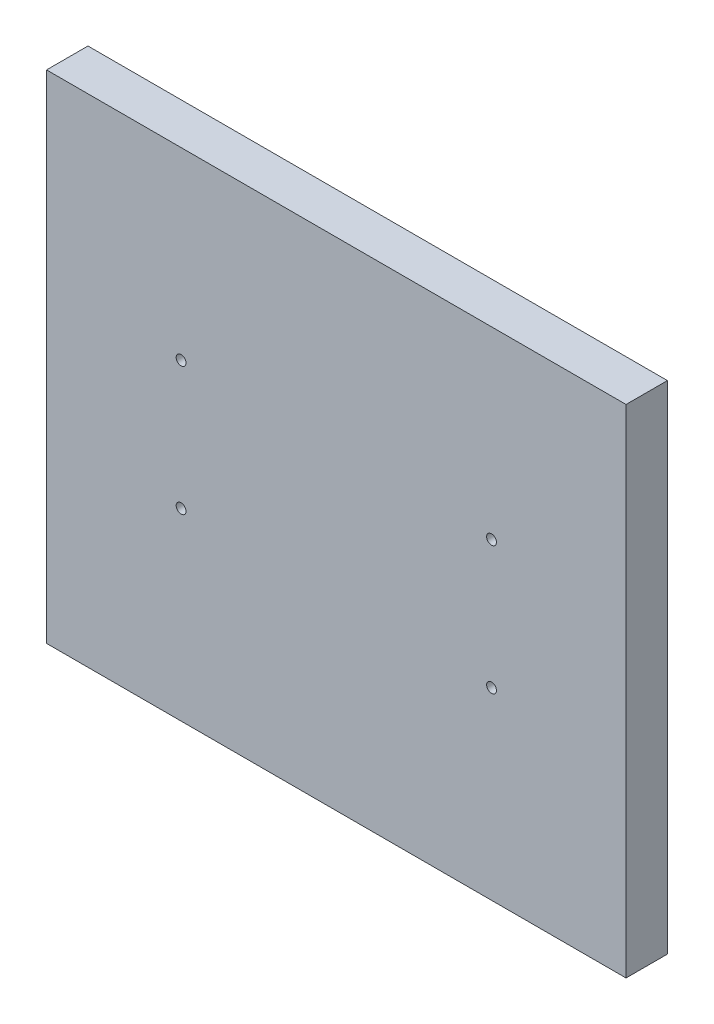
ISO-10303-21;
HEADER;
FILE_DESCRIPTION(('STEP AP214'),'2;1');
FILE_NAME('part.step','',(''),(''),'','','');
FILE_SCHEMA(('AUTOMOTIVE_DESIGN { 1 0 10303 214 1 1 1 1 }'));
ENDSEC;
DATA;
#1=APPLICATION_CONTEXT('core data for automotive mechanical design processes');
#2=APPLICATION_PROTOCOL_DEFINITION('international standard','automotive_design',2000,#1);
#3=PRODUCT_CONTEXT('',#1,'mechanical');
#4=PRODUCT('Part','Part','',(#3));
#5=PRODUCT_RELATED_PRODUCT_CATEGORY('part','',(#4));
#6=PRODUCT_DEFINITION_FORMATION('','',#4);
#7=PRODUCT_DEFINITION_CONTEXT('part definition',#1,'design');
#8=PRODUCT_DEFINITION('design','',#6,#7);
#9=PRODUCT_DEFINITION_SHAPE('','',#8);
#10=(LENGTH_UNIT() NAMED_UNIT(*) SI_UNIT(.MILLI.,.METRE.));
#11=(NAMED_UNIT(*) PLANE_ANGLE_UNIT() SI_UNIT($,.RADIAN.));
#12=(NAMED_UNIT(*) SI_UNIT($,.STERADIAN.) SOLID_ANGLE_UNIT());
#13=UNCERTAINTY_MEASURE_WITH_UNIT(LENGTH_MEASURE(1.E-05),#10,'distance_accuracy_value','');
#14=(GEOMETRIC_REPRESENTATION_CONTEXT(3) GLOBAL_UNCERTAINTY_ASSIGNED_CONTEXT((#13)) GLOBAL_UNIT_ASSIGNED_CONTEXT((#10,
#11,#12)) REPRESENTATION_CONTEXT('',''));
#15=CARTESIAN_POINT('',(0.,0.,0.));
#16=DIRECTION('',(0.,0.,1.));
#17=DIRECTION('',(1.,0.,0.));
#18=AXIS2_PLACEMENT_3D('',#15,#16,#17);
#19=CARTESIAN_POINT('',(70.,60.,10.));
#20=DIRECTION('',(-1.,0.,0.));
#21=DIRECTION('',(0.,-1.,0.));
#22=AXIS2_PLACEMENT_3D('',#19,#20,#21);
#23=PLANE('',#22);
#24=DIRECTION('',(0.,1.,0.));
#25=VECTOR('',#24,1.);
#26=CARTESIAN_POINT('',(70.,60.,0.));
#27=LINE('',#26,#25);
#28=CARTESIAN_POINT('',(70.0000000000001,-60.,0.));
#29=VERTEX_POINT('',#28);
#30=CARTESIAN_POINT('',(70.,60.,0.));
#31=VERTEX_POINT('',#30);
#32=EDGE_CURVE('E126',#29,#31,#27,.T.);
#33=ORIENTED_EDGE('',*,*,#32,.T.);
#34=DIRECTION('',(0.,0.,-1.));
#35=VECTOR('',#34,1.);
#36=CARTESIAN_POINT('',(70.,60.,10.));
#37=LINE('',#36,#35);
#38=CARTESIAN_POINT('',(70.,60.,10.));
#39=VERTEX_POINT('',#38);
#40=EDGE_CURVE('E11',#39,#31,#37,.T.);
#41=ORIENTED_EDGE('',*,*,#40,.F.);
#42=DIRECTION('',(0.,1.,0.));
#43=VECTOR('',#42,1.);
#44=CARTESIAN_POINT('',(70.,60.,10.));
#45=LINE('',#44,#43);
#46=CARTESIAN_POINT('',(70.0000000000001,-60.,10.));
#47=VERTEX_POINT('',#46);
#48=EDGE_CURVE('E127',#47,#39,#45,.T.);
#49=ORIENTED_EDGE('',*,*,#48,.F.);
#50=DIRECTION('',(0.,0.,-1.));
#51=VECTOR('',#50,1.);
#52=CARTESIAN_POINT('',(70.0000000000001,-60.,10.));
#53=LINE('',#52,#51);
#54=EDGE_CURVE('E133',#47,#29,#53,.T.);
#55=ORIENTED_EDGE('',*,*,#54,.T.);
#56=EDGE_LOOP('',(#33,#41,#49,#55));
#57=FACE_BOUND('',#56,.T.);
#58=ADVANCED_FACE('F33',(#57),#23,.F.);
#59=CARTESIAN_POINT('',(-70.,60.,10.));
#60=DIRECTION('',(0.,-1.,0.));
#61=DIRECTION('',(0.,0.,-1.));
#62=AXIS2_PLACEMENT_3D('',#59,#60,#61);
#63=PLANE('',#62);
#64=DIRECTION('',(-1.,0.,0.));
#65=VECTOR('',#64,1.);
#66=CARTESIAN_POINT('',(-70.,60.,0.));
#67=LINE('',#66,#65);
#68=CARTESIAN_POINT('',(-70.,60.,0.));
#69=VERTEX_POINT('',#68);
#70=EDGE_CURVE('E136',#31,#69,#67,.T.);
#71=ORIENTED_EDGE('',*,*,#70,.T.);
#72=DIRECTION('',(0.,0.,-1.));
#73=VECTOR('',#72,1.);
#74=CARTESIAN_POINT('',(-70.,60.,10.));
#75=LINE('',#74,#73);
#76=CARTESIAN_POINT('',(-70.,60.,10.));
#77=VERTEX_POINT('',#76);
#78=EDGE_CURVE('E41',#77,#69,#75,.T.);
#79=ORIENTED_EDGE('',*,*,#78,.F.);
#80=DIRECTION('',(-1.,0.,0.));
#81=VECTOR('',#80,1.);
#82=CARTESIAN_POINT('',(-70.,60.,10.));
#83=LINE('',#82,#81);
#84=EDGE_CURVE('E80',#39,#77,#83,.T.);
#85=ORIENTED_EDGE('',*,*,#84,.F.);
#86=ORIENTED_EDGE('',*,*,#40,.T.);
#87=EDGE_LOOP('',(#71,#79,#85,#86));
#88=FACE_BOUND('',#87,.T.);
#89=ADVANCED_FACE('F161',(#88),#63,.F.);
#90=CARTESIAN_POINT('',(-70.,60.,10.));
#91=DIRECTION('',(1.,0.,0.));
#92=DIRECTION('',(0.,1.,0.));
#93=AXIS2_PLACEMENT_3D('',#90,#91,#92);
#94=PLANE('',#93);
#95=DIRECTION('',(0.,-1.,0.));
#96=VECTOR('',#95,1.);
#97=CARTESIAN_POINT('',(-70.,60.,0.));
#98=LINE('',#97,#96);
#99=CARTESIAN_POINT('',(-70.,-60.,0.));
#100=VERTEX_POINT('',#99);
#101=EDGE_CURVE('E67',#69,#100,#98,.T.);
#102=ORIENTED_EDGE('',*,*,#101,.T.);
#103=DIRECTION('',(0.,0.,-1.));
#104=VECTOR('',#103,1.);
#105=CARTESIAN_POINT('',(-70.,-60.,10.));
#106=LINE('',#105,#104);
#107=CARTESIAN_POINT('',(-70.,-60.,10.));
#108=VERTEX_POINT('',#107);
#109=EDGE_CURVE('E141',#108,#100,#106,.T.);
#110=ORIENTED_EDGE('',*,*,#109,.F.);
#111=DIRECTION('',(0.,-1.,0.));
#112=VECTOR('',#111,1.);
#113=CARTESIAN_POINT('',(-70.,60.,10.));
#114=LINE('',#113,#112);
#115=EDGE_CURVE('E130',#77,#108,#114,.T.);
#116=ORIENTED_EDGE('',*,*,#115,.F.);
#117=ORIENTED_EDGE('',*,*,#78,.T.);
#118=EDGE_LOOP('',(#102,#110,#116,#117));
#119=FACE_BOUND('',#118,.T.);
#120=ADVANCED_FACE('F143',(#119),#94,.F.);
#121=CARTESIAN_POINT('',(-70.,-60.,10.));
#122=DIRECTION('',(0.,1.,0.));
#123=DIRECTION('',(0.,0.,1.));
#124=AXIS2_PLACEMENT_3D('',#121,#122,#123);
#125=PLANE('',#124);
#126=DIRECTION('',(1.,0.,0.));
#127=VECTOR('',#126,1.);
#128=CARTESIAN_POINT('',(-70.,-60.,0.));
#129=LINE('',#128,#127);
#130=EDGE_CURVE('E73',#100,#29,#129,.T.);
#131=ORIENTED_EDGE('',*,*,#130,.T.);
#132=ORIENTED_EDGE('',*,*,#54,.F.);
#133=DIRECTION('',(1.,0.,0.));
#134=VECTOR('',#133,1.);
#135=CARTESIAN_POINT('',(-70.,-60.,10.));
#136=LINE('',#135,#134);
#137=EDGE_CURVE('E49',#108,#47,#136,.T.);
#138=ORIENTED_EDGE('',*,*,#137,.F.);
#139=ORIENTED_EDGE('',*,*,#109,.T.);
#140=EDGE_LOOP('',(#131,#132,#138,#139));
#141=FACE_BOUND('',#140,.T.);
#142=ADVANCED_FACE('F150',(#141),#125,.F.);
#143=CARTESIAN_POINT('',(0.,0.,10.));
#144=DIRECTION('',(0.,0.,1.));
#145=DIRECTION('',(1.,0.,0.));
#146=AXIS2_PLACEMENT_3D('',#143,#144,#145);
#147=PLANE('',#146);
#148=CARTESIAN_POINT('',(-37.5,15.5,10.));
#149=DIRECTION('',(0.,0.,1.));
#150=DIRECTION('',(1.,0.,0.));
#151=AXIS2_PLACEMENT_3D('',#148,#149,#150);
#152=CIRCLE('',#151,1.18745);
#153=CARTESIAN_POINT('',(-36.31255,15.5,10.));
#154=VERTEX_POINT('',#153);
#155=EDGE_CURVE('E104',#154,#154,#152,.T.);
#156=ORIENTED_EDGE('',*,*,#155,.F.);
#157=EDGE_LOOP('',(#156));
#158=FACE_BOUND('',#157,.T.);
#159=CARTESIAN_POINT('',(-37.5,-15.5,10.));
#160=DIRECTION('',(0.,0.,1.));
#161=DIRECTION('',(1.,0.,0.));
#162=AXIS2_PLACEMENT_3D('',#159,#160,#161);
#163=CIRCLE('',#162,1.18745);
#164=CARTESIAN_POINT('',(-36.31255,-15.5,10.));
#165=VERTEX_POINT('',#164);
#166=EDGE_CURVE('E103',#165,#165,#163,.T.);
#167=ORIENTED_EDGE('',*,*,#166,.F.);
#168=EDGE_LOOP('',(#167));
#169=FACE_BOUND('',#168,.T.);
#170=CARTESIAN_POINT('',(37.5,15.5,10.));
#171=DIRECTION('',(0.,0.,1.));
#172=DIRECTION('',(1.,0.,0.));
#173=AXIS2_PLACEMENT_3D('',#170,#171,#172);
#174=CIRCLE('',#173,1.18745);
#175=CARTESIAN_POINT('',(38.68745,15.5,10.));
#176=VERTEX_POINT('',#175);
#177=EDGE_CURVE('E114',#176,#176,#174,.T.);
#178=ORIENTED_EDGE('',*,*,#177,.F.);
#179=EDGE_LOOP('',(#178));
#180=FACE_BOUND('',#179,.T.);
#181=CARTESIAN_POINT('',(37.5,-15.5,10.));
#182=DIRECTION('',(0.,0.,1.));
#183=DIRECTION('',(1.,0.,0.));
#184=AXIS2_PLACEMENT_3D('',#181,#182,#183);
#185=CIRCLE('',#184,1.18745);
#186=CARTESIAN_POINT('',(38.68745,-15.5,10.));
#187=VERTEX_POINT('',#186);
#188=EDGE_CURVE('E120',#187,#187,#185,.T.);
#189=ORIENTED_EDGE('',*,*,#188,.F.);
#190=EDGE_LOOP('',(#189));
#191=FACE_BOUND('',#190,.T.);
#192=ORIENTED_EDGE('',*,*,#48,.T.);
#193=ORIENTED_EDGE('',*,*,#84,.T.);
#194=ORIENTED_EDGE('',*,*,#115,.T.);
#195=ORIENTED_EDGE('',*,*,#137,.T.);
#196=EDGE_LOOP('',(#192,#193,#194,#195));
#197=FACE_BOUND('',#196,.T.);
#198=ADVANCED_FACE('F152',(#158,#169,#180,#191,#197),#147,.T.);
#199=CARTESIAN_POINT('',(0.,0.,0.));
#200=DIRECTION('',(0.,0.,1.));
#201=DIRECTION('',(1.,0.,0.));
#202=AXIS2_PLACEMENT_3D('',#199,#200,#201);
#203=PLANE('',#202);
#204=ORIENTED_EDGE('',*,*,#32,.F.);
#205=ORIENTED_EDGE('',*,*,#130,.F.);
#206=ORIENTED_EDGE('',*,*,#101,.F.);
#207=ORIENTED_EDGE('',*,*,#70,.F.);
#208=EDGE_LOOP('',(#204,#205,#206,#207));
#209=FACE_BOUND('',#208,.T.);
#210=ADVANCED_FACE('F146',(#209),#203,.F.);
#211=CARTESIAN_POINT('',(37.5,-15.5,2.73));
#212=DIRECTION('',(0.,0.,1.));
#213=DIRECTION('',(1.,0.,0.));
#214=AXIS2_PLACEMENT_3D('',#211,#212,#213);
#215=CONICAL_SURFACE('',#214,1.18745,1.02974425867665);
#216=CARTESIAN_POINT('',(37.5,-15.5,2.01650805793572));
#217=VERTEX_POINT('',#216);
#218=VERTEX_LOOP('',#217);
#219=FACE_BOUND('',#218,.T.);
#220=CARTESIAN_POINT('',(37.5,-15.5,2.73));
#221=DIRECTION('',(0.,0.,1.));
#222=DIRECTION('',(1.,0.,0.));
#223=AXIS2_PLACEMENT_3D('',#220,#221,#222);
#224=CIRCLE('',#223,1.18745);
#225=CARTESIAN_POINT('',(38.68745,-15.5,2.73));
#226=VERTEX_POINT('',#225);
#227=EDGE_CURVE('E123',#226,#226,#224,.T.);
#228=ORIENTED_EDGE('',*,*,#227,.T.);
#229=EDGE_LOOP('',(#228));
#230=FACE_BOUND('',#229,.T.);
#231=ADVANCED_FACE('F187',(#219,#230),#215,.F.);
#232=CARTESIAN_POINT('',(37.5,-15.5,10.));
#233=DIRECTION('',(0.,0.,1.));
#234=DIRECTION('',(1.,0.,0.));
#235=AXIS2_PLACEMENT_3D('',#232,#233,#234);
#236=CYLINDRICAL_SURFACE('',#235,1.18745);
#237=ORIENTED_EDGE('',*,*,#227,.F.);
#238=EDGE_LOOP('',(#237));
#239=FACE_BOUND('',#238,.T.);
#240=ORIENTED_EDGE('',*,*,#188,.T.);
#241=EDGE_LOOP('',(#240));
#242=FACE_BOUND('',#241,.T.);
#243=ADVANCED_FACE('F198',(#239,#242),#236,.F.);
#244=CARTESIAN_POINT('',(37.5,15.5,2.73));
#245=DIRECTION('',(0.,0.,1.));
#246=DIRECTION('',(1.,0.,0.));
#247=AXIS2_PLACEMENT_3D('',#244,#245,#246);
#248=CONICAL_SURFACE('',#247,1.18745,1.02974425867665);
#249=CARTESIAN_POINT('',(37.5,15.5,2.01650805793572));
#250=VERTEX_POINT('',#249);
#251=VERTEX_LOOP('',#250);
#252=FACE_BOUND('',#251,.T.);
#253=CARTESIAN_POINT('',(37.5,15.5,2.73));
#254=DIRECTION('',(0.,0.,1.));
#255=DIRECTION('',(1.,0.,0.));
#256=AXIS2_PLACEMENT_3D('',#253,#254,#255);
#257=CIRCLE('',#256,1.18745);
#258=CARTESIAN_POINT('',(38.68745,15.5,2.73));
#259=VERTEX_POINT('',#258);
#260=EDGE_CURVE('E117',#259,#259,#257,.T.);
#261=ORIENTED_EDGE('',*,*,#260,.T.);
#262=EDGE_LOOP('',(#261));
#263=FACE_BOUND('',#262,.T.);
#264=ADVANCED_FACE('F208',(#252,#263),#248,.F.);
#265=CARTESIAN_POINT('',(37.5,15.5,10.));
#266=DIRECTION('',(0.,0.,1.));
#267=DIRECTION('',(1.,0.,0.));
#268=AXIS2_PLACEMENT_3D('',#265,#266,#267);
#269=CYLINDRICAL_SURFACE('',#268,1.18745);
#270=ORIENTED_EDGE('',*,*,#260,.F.);
#271=EDGE_LOOP('',(#270));
#272=FACE_BOUND('',#271,.T.);
#273=ORIENTED_EDGE('',*,*,#177,.T.);
#274=EDGE_LOOP('',(#273));
#275=FACE_BOUND('',#274,.T.);
#276=ADVANCED_FACE('F218',(#272,#275),#269,.F.);
#277=CARTESIAN_POINT('',(-37.5,-15.5,2.73));
#278=DIRECTION('',(0.,0.,1.));
#279=DIRECTION('',(1.,0.,0.));
#280=AXIS2_PLACEMENT_3D('',#277,#278,#279);
#281=CONICAL_SURFACE('',#280,1.18745,1.02974425867665);
#282=CARTESIAN_POINT('',(-37.5,-15.5,2.01650805793572));
#283=VERTEX_POINT('',#282);
#284=VERTEX_LOOP('',#283);
#285=FACE_BOUND('',#284,.T.);
#286=CARTESIAN_POINT('',(-37.5,-15.5,2.73));
#287=DIRECTION('',(0.,0.,1.));
#288=DIRECTION('',(1.,0.,0.));
#289=AXIS2_PLACEMENT_3D('',#286,#287,#288);
#290=CIRCLE('',#289,1.18745);
#291=CARTESIAN_POINT('',(-36.31255,-15.5,2.73));
#292=VERTEX_POINT('',#291);
#293=EDGE_CURVE('E107',#292,#292,#290,.T.);
#294=ORIENTED_EDGE('',*,*,#293,.T.);
#295=EDGE_LOOP('',(#294));
#296=FACE_BOUND('',#295,.T.);
#297=ADVANCED_FACE('F228',(#285,#296),#281,.F.);
#298=CARTESIAN_POINT('',(-37.5,-15.5,10.));
#299=DIRECTION('',(0.,0.,1.));
#300=DIRECTION('',(1.,0.,0.));
#301=AXIS2_PLACEMENT_3D('',#298,#299,#300);
#302=CYLINDRICAL_SURFACE('',#301,1.18745);
#303=ORIENTED_EDGE('',*,*,#293,.F.);
#304=EDGE_LOOP('',(#303));
#305=FACE_BOUND('',#304,.T.);
#306=ORIENTED_EDGE('',*,*,#166,.T.);
#307=EDGE_LOOP('',(#306));
#308=FACE_BOUND('',#307,.T.);
#309=ADVANCED_FACE('F97',(#305,#308),#302,.F.);
#310=CARTESIAN_POINT('',(-37.5,15.5,2.73));
#311=DIRECTION('',(0.,0.,1.));
#312=DIRECTION('',(1.,0.,0.));
#313=AXIS2_PLACEMENT_3D('',#310,#311,#312);
#314=CONICAL_SURFACE('',#313,1.18745,1.02974425867665);
#315=CARTESIAN_POINT('',(-37.5,15.5,2.01650805793572));
#316=VERTEX_POINT('',#315);
#317=VERTEX_LOOP('',#316);
#318=FACE_BOUND('',#317,.T.);
#319=CARTESIAN_POINT('',(-37.5,15.5,2.73));
#320=DIRECTION('',(0.,0.,1.));
#321=DIRECTION('',(1.,0.,0.));
#322=AXIS2_PLACEMENT_3D('',#319,#320,#321);
#323=CIRCLE('',#322,1.18745);
#324=CARTESIAN_POINT('',(-36.31255,15.5,2.73));
#325=VERTEX_POINT('',#324);
#326=EDGE_CURVE('E101',#325,#325,#323,.T.);
#327=ORIENTED_EDGE('',*,*,#326,.T.);
#328=EDGE_LOOP('',(#327));
#329=FACE_BOUND('',#328,.T.);
#330=ADVANCED_FACE('F93',(#318,#329),#314,.F.);
#331=CARTESIAN_POINT('',(-37.5,15.5,10.));
#332=DIRECTION('',(0.,0.,1.));
#333=DIRECTION('',(1.,0.,0.));
#334=AXIS2_PLACEMENT_3D('',#331,#332,#333);
#335=CYLINDRICAL_SURFACE('',#334,1.18745);
#336=ORIENTED_EDGE('',*,*,#326,.F.);
#337=EDGE_LOOP('',(#336));
#338=FACE_BOUND('',#337,.T.);
#339=ORIENTED_EDGE('',*,*,#155,.T.);
#340=EDGE_LOOP('',(#339));
#341=FACE_BOUND('',#340,.T.);
#342=ADVANCED_FACE('F96',(#338,#341),#335,.F.);
#343=CLOSED_SHELL('',(#58,#89,#120,#142,#198,#210,#231,#243,#264,#276,#297,#309,#330,#342));
#344=MANIFOLD_SOLID_BREP('B2',#343);
#345=ADVANCED_BREP_SHAPE_REPRESENTATION('',(#18,#344),#14);
#346=SHAPE_DEFINITION_REPRESENTATION(#9,#345);
ENDSEC;
END-ISO-10303-21;
